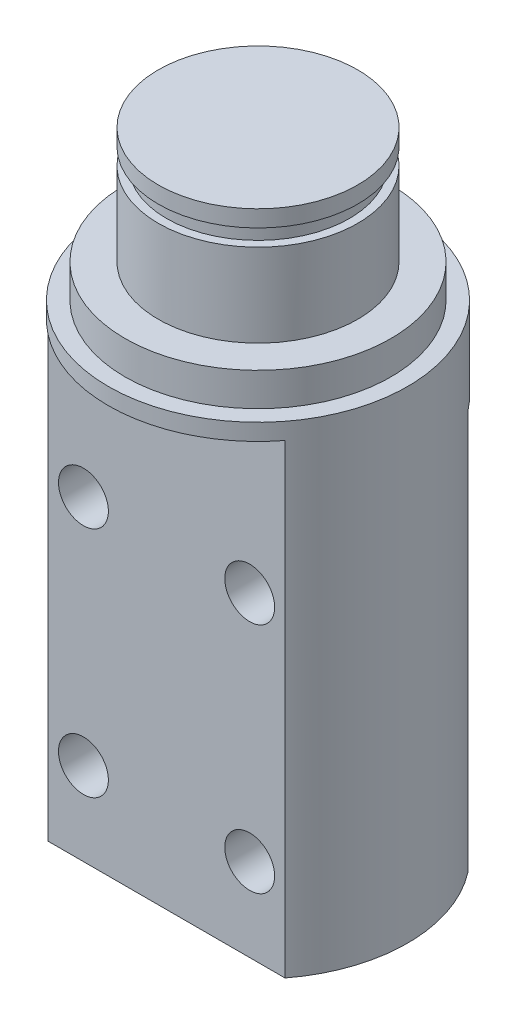
ISO-10303-21;
HEADER;
FILE_DESCRIPTION(('STEP AP214'),'2;1');
FILE_NAME('part.step','',(''),(''),'','','');
FILE_SCHEMA(('AUTOMOTIVE_DESIGN { 1 0 10303 214 1 1 1 1 }'));
ENDSEC;
DATA;
#1=APPLICATION_CONTEXT('core data for automotive mechanical design processes');
#2=APPLICATION_PROTOCOL_DEFINITION('international standard','automotive_design',2000,#1);
#3=PRODUCT_CONTEXT('',#1,'mechanical');
#4=PRODUCT('Part','Part','',(#3));
#5=PRODUCT_RELATED_PRODUCT_CATEGORY('part','',(#4));
#6=PRODUCT_DEFINITION_FORMATION('','',#4);
#7=PRODUCT_DEFINITION_CONTEXT('part definition',#1,'design');
#8=PRODUCT_DEFINITION('design','',#6,#7);
#9=PRODUCT_DEFINITION_SHAPE('','',#8);
#10=(LENGTH_UNIT() NAMED_UNIT(*) SI_UNIT(.MILLI.,.METRE.));
#11=(NAMED_UNIT(*) PLANE_ANGLE_UNIT() SI_UNIT($,.RADIAN.));
#12=(NAMED_UNIT(*) SI_UNIT($,.STERADIAN.) SOLID_ANGLE_UNIT());
#13=UNCERTAINTY_MEASURE_WITH_UNIT(LENGTH_MEASURE(1.E-05),#10,'distance_accuracy_value','');
#14=(GEOMETRIC_REPRESENTATION_CONTEXT(3) GLOBAL_UNCERTAINTY_ASSIGNED_CONTEXT((#13)) GLOBAL_UNIT_ASSIGNED_CONTEXT((#10,
#11,#12)) REPRESENTATION_CONTEXT('',''));
#15=CARTESIAN_POINT('',(0.,0.,0.));
#16=DIRECTION('',(0.,0.,1.));
#17=DIRECTION('',(1.,0.,0.));
#18=AXIS2_PLACEMENT_3D('',#15,#16,#17);
#19=CARTESIAN_POINT('',(0.,0.,0.));
#20=DIRECTION('',(0.,-1.,0.));
#21=DIRECTION('',(0.,0.,-1.));
#22=AXIS2_PLACEMENT_3D('',#19,#20,#21);
#23=PLANE('',#22);
#24=CARTESIAN_POINT('',(0.,0.,0.));
#25=DIRECTION('',(0.,-1.,0.));
#26=DIRECTION('',(0.,0.,-1.));
#27=AXIS2_PLACEMENT_3D('',#24,#25,#26);
#28=CIRCLE('',#27,6.);
#29=CARTESIAN_POINT('',(0.,0.,-6.));
#30=VERTEX_POINT('',#29);
#31=EDGE_CURVE('E97',#30,#30,#28,.T.);
#32=ORIENTED_EDGE('',*,*,#31,.T.);
#33=EDGE_LOOP('',(#32));
#34=FACE_BOUND('',#33,.T.);
#35=CARTESIAN_POINT('',(0.,0.,0.));
#36=DIRECTION('',(0.,1.,0.));
#37=DIRECTION('',(0.,0.,1.));
#38=AXIS2_PLACEMENT_3D('',#35,#36,#37);
#39=CIRCLE('',#38,8.);
#40=CARTESIAN_POINT('',(0.,0.,8.));
#41=VERTEX_POINT('',#40);
#42=EDGE_CURVE('E358',#41,#41,#39,.T.);
#43=ORIENTED_EDGE('',*,*,#42,.T.);
#44=EDGE_LOOP('',(#43));
#45=FACE_BOUND('',#44,.T.);
#46=ADVANCED_FACE('F36',(#34,#45),#23,.F.);
#47=CARTESIAN_POINT('',(0.,7.,0.));
#48=DIRECTION('',(0.,-1.,0.));
#49=DIRECTION('',(0.,0.,-1.));
#50=AXIS2_PLACEMENT_3D('',#47,#48,#49);
#51=CYLINDRICAL_SURFACE('',#50,6.);
#52=ORIENTED_EDGE('',*,*,#31,.F.);
#53=EDGE_LOOP('',(#52));
#54=FACE_BOUND('',#53,.T.);
#55=CARTESIAN_POINT('',(0.,5.,0.));
#56=DIRECTION('',(0.,1.,0.));
#57=DIRECTION('',(0.,0.,1.));
#58=AXIS2_PLACEMENT_3D('',#55,#56,#57);
#59=CIRCLE('',#58,6.);
#60=CARTESIAN_POINT('',(0.,5.,6.));
#61=VERTEX_POINT('',#60);
#62=EDGE_CURVE('E40',#61,#61,#59,.T.);
#63=ORIENTED_EDGE('',*,*,#62,.F.);
#64=EDGE_LOOP('',(#63));
#65=FACE_BOUND('',#64,.T.);
#66=ADVANCED_FACE('F176',(#54,#65),#51,.T.);
#67=CARTESIAN_POINT('',(0.,5.,0.));
#68=DIRECTION('',(0.,1.,0.));
#69=DIRECTION('',(0.,0.,1.));
#70=AXIS2_PLACEMENT_3D('',#67,#68,#69);
#71=PLANE('',#70);
#72=CARTESIAN_POINT('',(0.,5.,0.));
#73=DIRECTION('',(0.,1.,0.));
#74=DIRECTION('',(0.,0.,1.));
#75=AXIS2_PLACEMENT_3D('',#72,#73,#74);
#76=CIRCLE('',#75,5.5);
#77=CARTESIAN_POINT('',(0.,5.,5.5));
#78=VERTEX_POINT('',#77);
#79=EDGE_CURVE('E125',#78,#78,#76,.T.);
#80=ORIENTED_EDGE('',*,*,#79,.F.);
#81=EDGE_LOOP('',(#80));
#82=FACE_BOUND('',#81,.T.);
#83=ORIENTED_EDGE('',*,*,#62,.T.);
#84=EDGE_LOOP('',(#83));
#85=FACE_BOUND('',#84,.T.);
#86=ADVANCED_FACE('F182',(#82,#85),#71,.T.);
#87=CARTESIAN_POINT('',(0.,6.,0.));
#88=DIRECTION('',(0.,1.,0.));
#89=DIRECTION('',(0.,0.,1.));
#90=AXIS2_PLACEMENT_3D('',#87,#88,#89);
#91=PLANE('',#90);
#92=CARTESIAN_POINT('',(0.,6.,0.));
#93=DIRECTION('',(0.,1.,0.));
#94=DIRECTION('',(0.,0.,1.));
#95=AXIS2_PLACEMENT_3D('',#92,#93,#94);
#96=CIRCLE('',#95,5.5);
#97=CARTESIAN_POINT('',(0.,6.,5.5));
#98=VERTEX_POINT('',#97);
#99=EDGE_CURVE('E131',#98,#98,#96,.T.);
#100=ORIENTED_EDGE('',*,*,#99,.T.);
#101=EDGE_LOOP('',(#100));
#102=FACE_BOUND('',#101,.T.);
#103=CARTESIAN_POINT('',(0.,6.,0.));
#104=DIRECTION('',(0.,1.,0.));
#105=DIRECTION('',(0.,0.,1.));
#106=AXIS2_PLACEMENT_3D('',#103,#104,#105);
#107=CIRCLE('',#106,6.);
#108=CARTESIAN_POINT('',(0.,6.,6.));
#109=VERTEX_POINT('',#108);
#110=EDGE_CURVE('E123',#109,#109,#107,.T.);
#111=ORIENTED_EDGE('',*,*,#110,.F.);
#112=EDGE_LOOP('',(#111));
#113=FACE_BOUND('',#112,.T.);
#114=ADVANCED_FACE('F196',(#102,#113),#91,.F.);
#115=CARTESIAN_POINT('',(0.,5.,0.));
#116=DIRECTION('',(0.,1.,0.));
#117=DIRECTION('',(0.,0.,1.));
#118=AXIS2_PLACEMENT_3D('',#115,#116,#117);
#119=CYLINDRICAL_SURFACE('',#118,5.5);
#120=ORIENTED_EDGE('',*,*,#79,.T.);
#121=EDGE_LOOP('',(#120));
#122=FACE_BOUND('',#121,.T.);
#123=ORIENTED_EDGE('',*,*,#99,.F.);
#124=EDGE_LOOP('',(#123));
#125=FACE_BOUND('',#124,.T.);
#126=ADVANCED_FACE('F189',(#122,#125),#119,.T.);
#127=CARTESIAN_POINT('',(0.,7.,0.));
#128=DIRECTION('',(0.,1.,0.));
#129=DIRECTION('',(0.,0.,1.));
#130=AXIS2_PLACEMENT_3D('',#127,#128,#129);
#131=PLANE('',#130);
#132=CARTESIAN_POINT('',(0.,7.,0.));
#133=DIRECTION('',(0.,1.,0.));
#134=DIRECTION('',(0.,0.,1.));
#135=AXIS2_PLACEMENT_3D('',#132,#133,#134);
#136=CIRCLE('',#135,6.);
#137=CARTESIAN_POINT('',(0.,7.,6.));
#138=VERTEX_POINT('',#137);
#139=EDGE_CURVE('E101',#138,#138,#136,.T.);
#140=ORIENTED_EDGE('',*,*,#139,.T.);
#141=EDGE_LOOP('',(#140));
#142=FACE_BOUND('',#141,.T.);
#143=ADVANCED_FACE('F187',(#142),#131,.T.);
#144=ORIENTED_EDGE('',*,*,#110,.T.);
#145=EDGE_LOOP('',(#144));
#146=FACE_BOUND('',#145,.T.);
#147=ORIENTED_EDGE('',*,*,#139,.F.);
#148=EDGE_LOOP('',(#147));
#149=FACE_BOUND('',#148,.T.);
#150=ADVANCED_FACE('F38',(#146,#149),#51,.T.);
#151=CARTESIAN_POINT('',(0.,-2.,0.));
#152=DIRECTION('',(0.,1.,0.));
#153=DIRECTION('',(0.,0.,1.));
#154=AXIS2_PLACEMENT_3D('',#151,#152,#153);
#155=PLANE('',#154);
#156=CARTESIAN_POINT('',(0.,-2.,0.));
#157=DIRECTION('',(0.,1.,0.));
#158=DIRECTION('',(0.,0.,1.));
#159=AXIS2_PLACEMENT_3D('',#156,#157,#158);
#160=CIRCLE('',#159,8.);
#161=CARTESIAN_POINT('',(0.,-2.,8.));
#162=VERTEX_POINT('',#161);
#163=EDGE_CURVE('E355',#162,#162,#160,.T.);
#164=ORIENTED_EDGE('',*,*,#163,.F.);
#165=EDGE_LOOP('',(#164));
#166=FACE_BOUND('',#165,.T.);
#167=CARTESIAN_POINT('',(0.,-2.,0.));
#168=DIRECTION('',(0.,1.,0.));
#169=DIRECTION('',(0.,0.,1.));
#170=AXIS2_PLACEMENT_3D('',#167,#168,#169);
#171=CIRCLE('',#170,9.);
#172=CARTESIAN_POINT('',(0.,-2.,9.));
#173=VERTEX_POINT('',#172);
#174=EDGE_CURVE('E136',#173,#173,#171,.T.);
#175=ORIENTED_EDGE('',*,*,#174,.T.);
#176=EDGE_LOOP('',(#175));
#177=FACE_BOUND('',#176,.T.);
#178=ADVANCED_FACE('F195',(#166,#177),#155,.T.);
#179=CARTESIAN_POINT('',(0.,-2.,0.));
#180=DIRECTION('',(0.,1.,0.));
#181=DIRECTION('',(0.,0.,1.));
#182=AXIS2_PLACEMENT_3D('',#179,#180,#181);
#183=CYLINDRICAL_SURFACE('',#182,8.);
#184=ORIENTED_EDGE('',*,*,#163,.T.);
#185=EDGE_LOOP('',(#184));
#186=FACE_BOUND('',#185,.T.);
#187=ORIENTED_EDGE('',*,*,#42,.F.);
#188=EDGE_LOOP('',(#187));
#189=FACE_BOUND('',#188,.T.);
#190=ADVANCED_FACE('F225',(#186,#189),#183,.T.);
#191=CARTESIAN_POINT('',(5.,-26.,12.5));
#192=DIRECTION('',(0.,0.,-1.));
#193=DIRECTION('',(-1.,0.,0.));
#194=AXIS2_PLACEMENT_3D('',#191,#192,#193);
#195=CYLINDRICAL_SURFACE('',#194,1.5);
#196=CARTESIAN_POINT('',(5.,-26.,-5.5));
#197=DIRECTION('',(0.,0.,-1.));
#198=DIRECTION('',(-1.,0.,0.));
#199=AXIS2_PLACEMENT_3D('',#196,#197,#198);
#200=CIRCLE('',#199,1.5);
#201=CARTESIAN_POINT('',(3.5,-26.,-5.5));
#202=VERTEX_POINT('',#201);
#203=EDGE_CURVE('E113',#202,#202,#200,.T.);
#204=ORIENTED_EDGE('',*,*,#203,.T.);
#205=EDGE_LOOP('',(#204));
#206=FACE_BOUND('',#205,.T.);
#207=CARTESIAN_POINT('',(5.,-26.,5.5));
#208=DIRECTION('',(0.,0.,-1.));
#209=DIRECTION('',(-1.,0.,0.));
#210=AXIS2_PLACEMENT_3D('',#207,#208,#209);
#211=CIRCLE('',#210,1.5);
#212=CARTESIAN_POINT('',(3.5,-26.,5.5));
#213=VERTEX_POINT('',#212);
#214=EDGE_CURVE('E110',#213,#213,#211,.T.);
#215=ORIENTED_EDGE('',*,*,#214,.F.);
#216=EDGE_LOOP('',(#215));
#217=FACE_BOUND('',#216,.T.);
#218=ADVANCED_FACE('F222',(#206,#217),#195,.F.);
#219=CARTESIAN_POINT('',(5.,-12.,12.5));
#220=DIRECTION('',(0.,0.,-1.));
#221=DIRECTION('',(-1.,0.,0.));
#222=AXIS2_PLACEMENT_3D('',#219,#220,#221);
#223=CYLINDRICAL_SURFACE('',#222,1.5);
#224=CARTESIAN_POINT('',(5.,-12.,-5.5));
#225=DIRECTION('',(0.,0.,-1.));
#226=DIRECTION('',(-1.,0.,0.));
#227=AXIS2_PLACEMENT_3D('',#224,#225,#226);
#228=CIRCLE('',#227,1.5);
#229=CARTESIAN_POINT('',(3.5,-12.,-5.5));
#230=VERTEX_POINT('',#229);
#231=EDGE_CURVE('E129',#230,#230,#228,.T.);
#232=ORIENTED_EDGE('',*,*,#231,.T.);
#233=EDGE_LOOP('',(#232));
#234=FACE_BOUND('',#233,.T.);
#235=CARTESIAN_POINT('',(5.,-12.,5.5));
#236=DIRECTION('',(0.,0.,-1.));
#237=DIRECTION('',(-1.,0.,0.));
#238=AXIS2_PLACEMENT_3D('',#235,#236,#237);
#239=CIRCLE('',#238,1.5);
#240=CARTESIAN_POINT('',(3.5,-12.,5.5));
#241=VERTEX_POINT('',#240);
#242=EDGE_CURVE('E114',#241,#241,#239,.T.);
#243=ORIENTED_EDGE('',*,*,#242,.F.);
#244=EDGE_LOOP('',(#243));
#245=FACE_BOUND('',#244,.T.);
#246=ADVANCED_FACE('F218',(#234,#245),#223,.F.);
#247=CARTESIAN_POINT('',(-5.,-12.,12.5));
#248=DIRECTION('',(0.,0.,-1.));
#249=DIRECTION('',(-1.,0.,0.));
#250=AXIS2_PLACEMENT_3D('',#247,#248,#249);
#251=CYLINDRICAL_SURFACE('',#250,1.5);
#252=CARTESIAN_POINT('',(-5.,-12.,-5.5));
#253=DIRECTION('',(0.,0.,-1.));
#254=DIRECTION('',(-1.,0.,0.));
#255=AXIS2_PLACEMENT_3D('',#252,#253,#254);
#256=CIRCLE('',#255,1.5);
#257=CARTESIAN_POINT('',(-6.5,-12.,-5.5));
#258=VERTEX_POINT('',#257);
#259=EDGE_CURVE('E143',#258,#258,#256,.T.);
#260=ORIENTED_EDGE('',*,*,#259,.T.);
#261=EDGE_LOOP('',(#260));
#262=FACE_BOUND('',#261,.T.);
#263=CARTESIAN_POINT('',(-5.,-12.,5.5));
#264=DIRECTION('',(0.,0.,-1.));
#265=DIRECTION('',(-1.,0.,0.));
#266=AXIS2_PLACEMENT_3D('',#263,#264,#265);
#267=CIRCLE('',#266,1.5);
#268=CARTESIAN_POINT('',(-6.5,-12.,5.5));
#269=VERTEX_POINT('',#268);
#270=EDGE_CURVE('E117',#269,#269,#267,.T.);
#271=ORIENTED_EDGE('',*,*,#270,.F.);
#272=EDGE_LOOP('',(#271));
#273=FACE_BOUND('',#272,.T.);
#274=ADVANCED_FACE('F214',(#262,#273),#251,.F.);
#275=CARTESIAN_POINT('',(-5.,-26.,12.5));
#276=DIRECTION('',(0.,0.,-1.));
#277=DIRECTION('',(-1.,0.,0.));
#278=AXIS2_PLACEMENT_3D('',#275,#276,#277);
#279=CYLINDRICAL_SURFACE('',#278,1.5);
#280=CARTESIAN_POINT('',(-5.,-26.,-5.5));
#281=DIRECTION('',(0.,0.,-1.));
#282=DIRECTION('',(-1.,0.,0.));
#283=AXIS2_PLACEMENT_3D('',#280,#281,#282);
#284=CIRCLE('',#283,1.5);
#285=CARTESIAN_POINT('',(-6.5,-26.,-5.5));
#286=VERTEX_POINT('',#285);
#287=EDGE_CURVE('E118',#286,#286,#284,.T.);
#288=ORIENTED_EDGE('',*,*,#287,.T.);
#289=EDGE_LOOP('',(#288));
#290=FACE_BOUND('',#289,.T.);
#291=CARTESIAN_POINT('',(-5.,-26.,5.5));
#292=DIRECTION('',(0.,0.,-1.));
#293=DIRECTION('',(-1.,0.,0.));
#294=AXIS2_PLACEMENT_3D('',#291,#292,#293);
#295=CIRCLE('',#294,1.5);
#296=CARTESIAN_POINT('',(-6.5,-26.,5.5));
#297=VERTEX_POINT('',#296);
#298=EDGE_CURVE('E121',#297,#297,#295,.T.);
#299=ORIENTED_EDGE('',*,*,#298,.F.);
#300=EDGE_LOOP('',(#299));
#301=FACE_BOUND('',#300,.T.);
#302=ADVANCED_FACE('F170',(#290,#301),#279,.F.);
#303=CARTESIAN_POINT('',(0.,-7.,0.));
#304=DIRECTION('',(0.,-1.,0.));
#305=DIRECTION('',(0.,0.,-1.));
#306=AXIS2_PLACEMENT_3D('',#303,#304,#305);
#307=PLANE('',#306);
#308=CARTESIAN_POINT('',(0.,-7.,0.));
#309=DIRECTION('',(0.,-1.,0.));
#310=DIRECTION('',(0.,0.,-1.));
#311=AXIS2_PLACEMENT_3D('',#308,#309,#310);
#312=CIRCLE('',#311,9.);
#313=CARTESIAN_POINT('',(-7.1239034243875,-7.,-5.5));
#314=VERTEX_POINT('',#313);
#315=CARTESIAN_POINT('',(7.1239034243875,-7.,-5.5));
#316=VERTEX_POINT('',#315);
#317=EDGE_CURVE('E86',#314,#316,#312,.T.);
#318=ORIENTED_EDGE('',*,*,#317,.T.);
#319=DIRECTION('',(-1.,0.,0.));
#320=VECTOR('',#319,1.);
#321=CARTESIAN_POINT('',(-8.73090629366238,-7.,-5.5));
#322=LINE('',#321,#320);
#323=EDGE_CURVE('E152',#316,#314,#322,.T.);
#324=ORIENTED_EDGE('',*,*,#323,.T.);
#325=EDGE_LOOP('',(#318,#324));
#326=FACE_BOUND('',#325,.T.);
#327=ADVANCED_FACE('F158',(#326),#307,.T.);
#328=CARTESIAN_POINT('',(-8.73090629366238,-7.,-5.5));
#329=DIRECTION('',(0.,0.,1.));
#330=DIRECTION('',(1.,0.,0.));
#331=AXIS2_PLACEMENT_3D('',#328,#329,#330);
#332=PLANE('',#331);
#333=ORIENTED_EDGE('',*,*,#287,.F.);
#334=EDGE_LOOP('',(#333));
#335=FACE_BOUND('',#334,.T.);
#336=ORIENTED_EDGE('',*,*,#259,.F.);
#337=EDGE_LOOP('',(#336));
#338=FACE_BOUND('',#337,.T.);
#339=ORIENTED_EDGE('',*,*,#231,.F.);
#340=EDGE_LOOP('',(#339));
#341=FACE_BOUND('',#340,.T.);
#342=ORIENTED_EDGE('',*,*,#203,.F.);
#343=EDGE_LOOP('',(#342));
#344=FACE_BOUND('',#343,.T.);
#345=DIRECTION('',(-1.,0.,0.));
#346=VECTOR('',#345,1.);
#347=CARTESIAN_POINT('',(0.,-31.,-5.5));
#348=LINE('',#347,#346);
#349=CARTESIAN_POINT('',(7.1239034243875,-31.,-5.5));
#350=VERTEX_POINT('',#349);
#351=CARTESIAN_POINT('',(-7.1239034243875,-31.,-5.5));
#352=VERTEX_POINT('',#351);
#353=EDGE_CURVE('E96',#350,#352,#348,.T.);
#354=ORIENTED_EDGE('',*,*,#353,.T.);
#355=DIRECTION('',(0.,1.,0.));
#356=VECTOR('',#355,1.);
#357=CARTESIAN_POINT('',(-7.1239034243875,-31.,-5.5));
#358=LINE('',#357,#356);
#359=EDGE_CURVE('E154',#314,#352,#358,.F.);
#360=ORIENTED_EDGE('',*,*,#359,.F.);
#361=ORIENTED_EDGE('',*,*,#323,.F.);
#362=DIRECTION('',(0.,1.,0.));
#363=VECTOR('',#362,1.);
#364=CARTESIAN_POINT('',(7.1239034243875,-31.,-5.5));
#365=LINE('',#364,#363);
#366=EDGE_CURVE('E61',#350,#316,#365,.T.);
#367=ORIENTED_EDGE('',*,*,#366,.F.);
#368=EDGE_LOOP('',(#354,#360,#361,#367));
#369=FACE_BOUND('',#368,.T.);
#370=ADVANCED_FACE('F159',(#335,#338,#341,#344,#369),#332,.F.);
#371=CARTESIAN_POINT('',(0.,-3.,0.));
#372=DIRECTION('',(0.,-1.,0.));
#373=DIRECTION('',(0.,0.,-1.));
#374=AXIS2_PLACEMENT_3D('',#371,#372,#373);
#375=PLANE('',#374);
#376=DIRECTION('',(1.,0.,0.));
#377=VECTOR('',#376,1.);
#378=CARTESIAN_POINT('',(-8.63736086908743,-3.,5.5));
#379=LINE('',#378,#377);
#380=CARTESIAN_POINT('',(-7.1239034243875,-3.,5.5));
#381=VERTEX_POINT('',#380);
#382=CARTESIAN_POINT('',(7.1239034243875,-3.,5.5));
#383=VERTEX_POINT('',#382);
#384=EDGE_CURVE('E93',#381,#383,#379,.T.);
#385=ORIENTED_EDGE('',*,*,#384,.T.);
#386=CARTESIAN_POINT('',(0.,-3.,0.));
#387=DIRECTION('',(0.,-1.,0.));
#388=DIRECTION('',(0.,0.,-1.));
#389=AXIS2_PLACEMENT_3D('',#386,#387,#388);
#390=CIRCLE('',#389,9.);
#391=EDGE_CURVE('E11',#383,#381,#390,.T.);
#392=ORIENTED_EDGE('',*,*,#391,.T.);
#393=EDGE_LOOP('',(#385,#392));
#394=FACE_BOUND('',#393,.T.);
#395=ADVANCED_FACE('F161',(#394),#375,.T.);
#396=CARTESIAN_POINT('',(-8.63736086908743,-3.,5.5));
#397=DIRECTION('',(0.,0.,-1.));
#398=DIRECTION('',(-1.,0.,0.));
#399=AXIS2_PLACEMENT_3D('',#396,#397,#398);
#400=PLANE('',#399);
#401=ORIENTED_EDGE('',*,*,#298,.T.);
#402=EDGE_LOOP('',(#401));
#403=FACE_BOUND('',#402,.T.);
#404=ORIENTED_EDGE('',*,*,#270,.T.);
#405=EDGE_LOOP('',(#404));
#406=FACE_BOUND('',#405,.T.);
#407=ORIENTED_EDGE('',*,*,#242,.T.);
#408=EDGE_LOOP('',(#407));
#409=FACE_BOUND('',#408,.T.);
#410=ORIENTED_EDGE('',*,*,#214,.T.);
#411=EDGE_LOOP('',(#410));
#412=FACE_BOUND('',#411,.T.);
#413=DIRECTION('',(1.,0.,0.));
#414=VECTOR('',#413,1.);
#415=CARTESIAN_POINT('',(0.,-31.,5.5));
#416=LINE('',#415,#414);
#417=CARTESIAN_POINT('',(-7.1239034243875,-31.,5.5));
#418=VERTEX_POINT('',#417);
#419=CARTESIAN_POINT('',(7.1239034243875,-31.,5.5));
#420=VERTEX_POINT('',#419);
#421=EDGE_CURVE('E45',#418,#420,#416,.T.);
#422=ORIENTED_EDGE('',*,*,#421,.T.);
#423=DIRECTION('',(0.,1.,0.));
#424=VECTOR('',#423,1.);
#425=CARTESIAN_POINT('',(7.1239034243875,-31.,5.5));
#426=LINE('',#425,#424);
#427=EDGE_CURVE('E81',#383,#420,#426,.F.);
#428=ORIENTED_EDGE('',*,*,#427,.F.);
#429=ORIENTED_EDGE('',*,*,#384,.F.);
#430=DIRECTION('',(0.,1.,0.));
#431=VECTOR('',#430,1.);
#432=CARTESIAN_POINT('',(-7.1239034243875,-31.,5.5));
#433=LINE('',#432,#431);
#434=EDGE_CURVE('E53',#418,#381,#433,.T.);
#435=ORIENTED_EDGE('',*,*,#434,.F.);
#436=EDGE_LOOP('',(#422,#428,#429,#435));
#437=FACE_BOUND('',#436,.T.);
#438=ADVANCED_FACE('F80',(#403,#406,#409,#412,#437),#400,.F.);
#439=CARTESIAN_POINT('',(0.,-31.,0.));
#440=DIRECTION('',(0.,-1.,0.));
#441=DIRECTION('',(0.,0.,-1.));
#442=AXIS2_PLACEMENT_3D('',#439,#440,#441);
#443=PLANE('',#442);
#444=ORIENTED_EDGE('',*,*,#421,.F.);
#445=CARTESIAN_POINT('',(0.,-31.,0.));
#446=DIRECTION('',(0.,-1.,0.));
#447=DIRECTION('',(0.,0.,-1.));
#448=AXIS2_PLACEMENT_3D('',#445,#446,#447);
#449=CIRCLE('',#448,9.);
#450=EDGE_CURVE('E98',#418,#352,#449,.T.);
#451=ORIENTED_EDGE('',*,*,#450,.T.);
#452=ORIENTED_EDGE('',*,*,#353,.F.);
#453=EDGE_CURVE('E92',#350,#420,#449,.T.);
#454=ORIENTED_EDGE('',*,*,#453,.T.);
#455=EDGE_LOOP('',(#444,#451,#452,#454));
#456=FACE_BOUND('',#455,.T.);
#457=ADVANCED_FACE('F95',(#456),#443,.T.);
#458=CARTESIAN_POINT('',(0.,-31.,0.));
#459=DIRECTION('',(0.,1.,0.));
#460=DIRECTION('',(0.,0.,1.));
#461=AXIS2_PLACEMENT_3D('',#458,#459,#460);
#462=CYLINDRICAL_SURFACE('',#461,9.);
#463=ORIENTED_EDGE('',*,*,#450,.F.);
#464=ORIENTED_EDGE('',*,*,#434,.T.);
#465=ORIENTED_EDGE('',*,*,#391,.F.);
#466=ORIENTED_EDGE('',*,*,#427,.T.);
#467=ORIENTED_EDGE('',*,*,#453,.F.);
#468=ORIENTED_EDGE('',*,*,#366,.T.);
#469=ORIENTED_EDGE('',*,*,#317,.F.);
#470=ORIENTED_EDGE('',*,*,#359,.T.);
#471=EDGE_LOOP('',(#463,#464,#465,#466,#467,#468,#469,#470));
#472=FACE_BOUND('',#471,.T.);
#473=ORIENTED_EDGE('',*,*,#174,.F.);
#474=EDGE_LOOP('',(#473));
#475=FACE_BOUND('',#474,.T.);
#476=ADVANCED_FACE('F90',(#472,#475),#462,.T.);
#477=CLOSED_SHELL('',(#46,#66,#86,#114,#126,#143,#150,#178,#190,#218,#246,#274,#302,#327,#370,
#395,#438,#457,#476));
#478=MANIFOLD_SOLID_BREP('B2',#477);
#479=ADVANCED_BREP_SHAPE_REPRESENTATION('',(#18,#478),#14);
#480=SHAPE_DEFINITION_REPRESENTATION(#9,#479);
ENDSEC;
END-ISO-10303-21;
